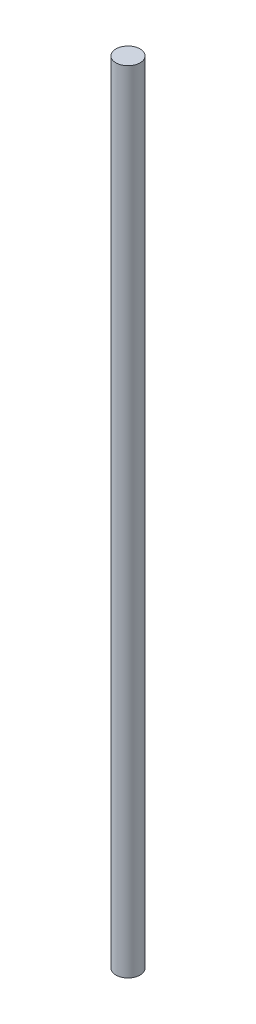
ISO-10303-21;
HEADER;
FILE_DESCRIPTION(('STEP AP214'),'2;1');
FILE_NAME('part.step','',(''),(''),'','','');
FILE_SCHEMA(('AUTOMOTIVE_DESIGN { 1 0 10303 214 1 1 1 1 }'));
ENDSEC;
DATA;
#1=APPLICATION_CONTEXT('core data for automotive mechanical design processes');
#2=APPLICATION_PROTOCOL_DEFINITION('international standard','automotive_design',2000,#1);
#3=PRODUCT_CONTEXT('',#1,'mechanical');
#4=PRODUCT('Part','Part','',(#3));
#5=PRODUCT_RELATED_PRODUCT_CATEGORY('part','',(#4));
#6=PRODUCT_DEFINITION_FORMATION('','',#4);
#7=PRODUCT_DEFINITION_CONTEXT('part definition',#1,'design');
#8=PRODUCT_DEFINITION('design','',#6,#7);
#9=PRODUCT_DEFINITION_SHAPE('','',#8);
#10=(LENGTH_UNIT() NAMED_UNIT(*) SI_UNIT(.MILLI.,.METRE.));
#11=(NAMED_UNIT(*) PLANE_ANGLE_UNIT() SI_UNIT($,.RADIAN.));
#12=(NAMED_UNIT(*) SI_UNIT($,.STERADIAN.) SOLID_ANGLE_UNIT());
#13=UNCERTAINTY_MEASURE_WITH_UNIT(LENGTH_MEASURE(1.E-05),#10,'distance_accuracy_value','');
#14=(GEOMETRIC_REPRESENTATION_CONTEXT(3) GLOBAL_UNCERTAINTY_ASSIGNED_CONTEXT((#13)) GLOBAL_UNIT_ASSIGNED_CONTEXT((#10,
#11,#12)) REPRESENTATION_CONTEXT('',''));
#15=CARTESIAN_POINT('',(0.,0.,0.));
#16=DIRECTION('',(0.,0.,1.));
#17=DIRECTION('',(1.,0.,0.));
#18=AXIS2_PLACEMENT_3D('',#15,#16,#17);
#19=CARTESIAN_POINT('',(0.,654.,0.));
#20=DIRECTION('',(0.,-1.,0.));
#21=DIRECTION('',(0.,0.,-1.));
#22=AXIS2_PLACEMENT_3D('',#19,#20,#21);
#23=CYLINDRICAL_SURFACE('',#22,10.);
#24=CARTESIAN_POINT('',(0.,654.,0.));
#25=DIRECTION('',(0.,1.,0.));
#26=DIRECTION('',(0.,0.,1.));
#27=AXIS2_PLACEMENT_3D('',#24,#25,#26);
#28=CIRCLE('',#27,10.);
#29=CARTESIAN_POINT('',(0.,654.,10.));
#30=VERTEX_POINT('',#29);
#31=EDGE_CURVE('E10',#30,#30,#28,.T.);
#32=ORIENTED_EDGE('',*,*,#31,.F.);
#33=EDGE_LOOP('',(#32));
#34=FACE_BOUND('',#33,.T.);
#35=CARTESIAN_POINT('',(0.,0.,0.));
#36=DIRECTION('',(0.,1.,0.));
#37=DIRECTION('',(0.,0.,1.));
#38=AXIS2_PLACEMENT_3D('',#35,#36,#37);
#39=CIRCLE('',#38,10.);
#40=CARTESIAN_POINT('',(0.,0.,10.));
#41=VERTEX_POINT('',#40);
#42=EDGE_CURVE('E47',#41,#41,#39,.T.);
#43=ORIENTED_EDGE('',*,*,#42,.T.);
#44=EDGE_LOOP('',(#43));
#45=FACE_BOUND('',#44,.T.);
#46=ADVANCED_FACE('F44',(#34,#45),#23,.T.);
#47=CARTESIAN_POINT('',(0.,654.,0.));
#48=DIRECTION('',(0.,1.,0.));
#49=DIRECTION('',(0.,0.,1.));
#50=AXIS2_PLACEMENT_3D('',#47,#48,#49);
#51=PLANE('',#50);
#52=ORIENTED_EDGE('',*,*,#31,.T.);
#53=EDGE_LOOP('',(#52));
#54=FACE_BOUND('',#53,.T.);
#55=ADVANCED_FACE('F59',(#54),#51,.T.);
#56=CARTESIAN_POINT('',(0.,0.,0.));
#57=DIRECTION('',(0.,1.,0.));
#58=DIRECTION('',(0.,0.,1.));
#59=AXIS2_PLACEMENT_3D('',#56,#57,#58);
#60=PLANE('',#59);
#61=ORIENTED_EDGE('',*,*,#42,.F.);
#62=EDGE_LOOP('',(#61));
#63=FACE_BOUND('',#62,.T.);
#64=ADVANCED_FACE('F57',(#63),#60,.F.);
#65=CLOSED_SHELL('',(#46,#55,#64));
#66=MANIFOLD_SOLID_BREP('B2',#65);
#67=ADVANCED_BREP_SHAPE_REPRESENTATION('',(#18,#66),#14);
#68=SHAPE_DEFINITION_REPRESENTATION(#9,#67);
ENDSEC;
END-ISO-10303-21;
